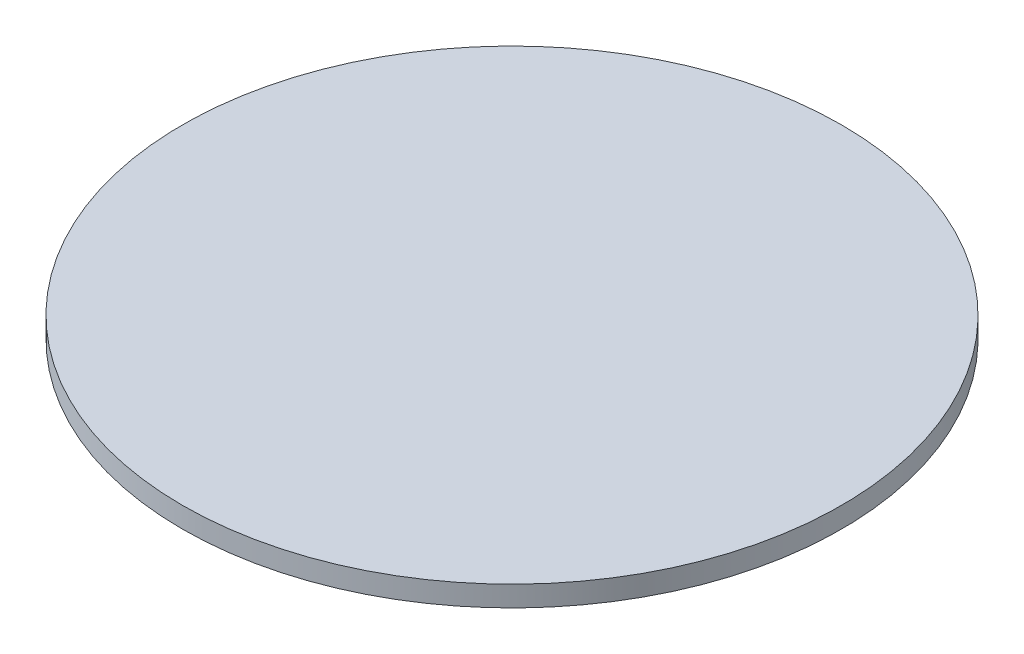
ISO-10303-21;
HEADER;
FILE_DESCRIPTION(('STEP AP214'),'2;1');
FILE_NAME('part.step','',(''),(''),'','','');
FILE_SCHEMA(('AUTOMOTIVE_DESIGN { 1 0 10303 214 1 1 1 1 }'));
ENDSEC;
DATA;
#1=APPLICATION_CONTEXT('core data for automotive mechanical design processes');
#2=APPLICATION_PROTOCOL_DEFINITION('international standard','automotive_design',2000,#1);
#3=PRODUCT_CONTEXT('',#1,'mechanical');
#4=PRODUCT('Part','Part','',(#3));
#5=PRODUCT_RELATED_PRODUCT_CATEGORY('part','',(#4));
#6=PRODUCT_DEFINITION_FORMATION('','',#4);
#7=PRODUCT_DEFINITION_CONTEXT('part definition',#1,'design');
#8=PRODUCT_DEFINITION('design','',#6,#7);
#9=PRODUCT_DEFINITION_SHAPE('','',#8);
#10=(LENGTH_UNIT() NAMED_UNIT(*) SI_UNIT(.MILLI.,.METRE.));
#11=(NAMED_UNIT(*) PLANE_ANGLE_UNIT() SI_UNIT($,.RADIAN.));
#12=(NAMED_UNIT(*) SI_UNIT($,.STERADIAN.) SOLID_ANGLE_UNIT());
#13=UNCERTAINTY_MEASURE_WITH_UNIT(LENGTH_MEASURE(1.E-05),#10,'distance_accuracy_value','');
#14=(GEOMETRIC_REPRESENTATION_CONTEXT(3) GLOBAL_UNCERTAINTY_ASSIGNED_CONTEXT((#13)) GLOBAL_UNIT_ASSIGNED_CONTEXT((#10,
#11,#12)) REPRESENTATION_CONTEXT('',''));
#15=CARTESIAN_POINT('',(0.,0.,0.));
#16=DIRECTION('',(0.,0.,1.));
#17=DIRECTION('',(1.,0.,0.));
#18=AXIS2_PLACEMENT_3D('',#15,#16,#17);
#19=CARTESIAN_POINT('',(0.,3.175,0.));
#20=DIRECTION('',(0.,-1.,0.));
#21=DIRECTION('',(0.,0.,-1.));
#22=AXIS2_PLACEMENT_3D('',#19,#20,#21);
#23=CYLINDRICAL_SURFACE('',#22,50.8);
#24=CARTESIAN_POINT('',(0.,3.175,0.));
#25=DIRECTION('',(0.,1.,0.));
#26=DIRECTION('',(0.,0.,1.));
#27=AXIS2_PLACEMENT_3D('',#24,#25,#26);
#28=CIRCLE('',#27,50.8);
#29=CARTESIAN_POINT('',(0.,3.175,50.8));
#30=VERTEX_POINT('',#29);
#31=EDGE_CURVE('E10',#30,#30,#28,.T.);
#32=ORIENTED_EDGE('',*,*,#31,.F.);
#33=EDGE_LOOP('',(#32));
#34=FACE_BOUND('',#33,.T.);
#35=CARTESIAN_POINT('',(0.,0.,0.));
#36=DIRECTION('',(0.,1.,0.));
#37=DIRECTION('',(0.,0.,1.));
#38=AXIS2_PLACEMENT_3D('',#35,#36,#37);
#39=CIRCLE('',#38,50.8);
#40=CARTESIAN_POINT('',(0.,0.,50.8));
#41=VERTEX_POINT('',#40);
#42=EDGE_CURVE('E40',#41,#41,#39,.T.);
#43=ORIENTED_EDGE('',*,*,#42,.T.);
#44=EDGE_LOOP('',(#43));
#45=FACE_BOUND('',#44,.T.);
#46=ADVANCED_FACE('F37',(#34,#45),#23,.T.);
#47=CARTESIAN_POINT('',(0.,3.175,0.));
#48=DIRECTION('',(0.,1.,0.));
#49=DIRECTION('',(0.,0.,1.));
#50=AXIS2_PLACEMENT_3D('',#47,#48,#49);
#51=PLANE('',#50);
#52=ORIENTED_EDGE('',*,*,#31,.T.);
#53=EDGE_LOOP('',(#52));
#54=FACE_BOUND('',#53,.T.);
#55=ADVANCED_FACE('F54',(#54),#51,.T.);
#56=CARTESIAN_POINT('',(0.,0.,0.));
#57=DIRECTION('',(0.,1.,0.));
#58=DIRECTION('',(0.,0.,1.));
#59=AXIS2_PLACEMENT_3D('',#56,#57,#58);
#60=PLANE('',#59);
#61=ORIENTED_EDGE('',*,*,#42,.F.);
#62=EDGE_LOOP('',(#61));
#63=FACE_BOUND('',#62,.T.);
#64=ADVANCED_FACE('F52',(#63),#60,.F.);
#65=CLOSED_SHELL('',(#46,#55,#64));
#66=MANIFOLD_SOLID_BREP('B2',#65);
#67=ADVANCED_BREP_SHAPE_REPRESENTATION('',(#18,#66),#14);
#68=SHAPE_DEFINITION_REPRESENTATION(#9,#67);
ENDSEC;
END-ISO-10303-21;
